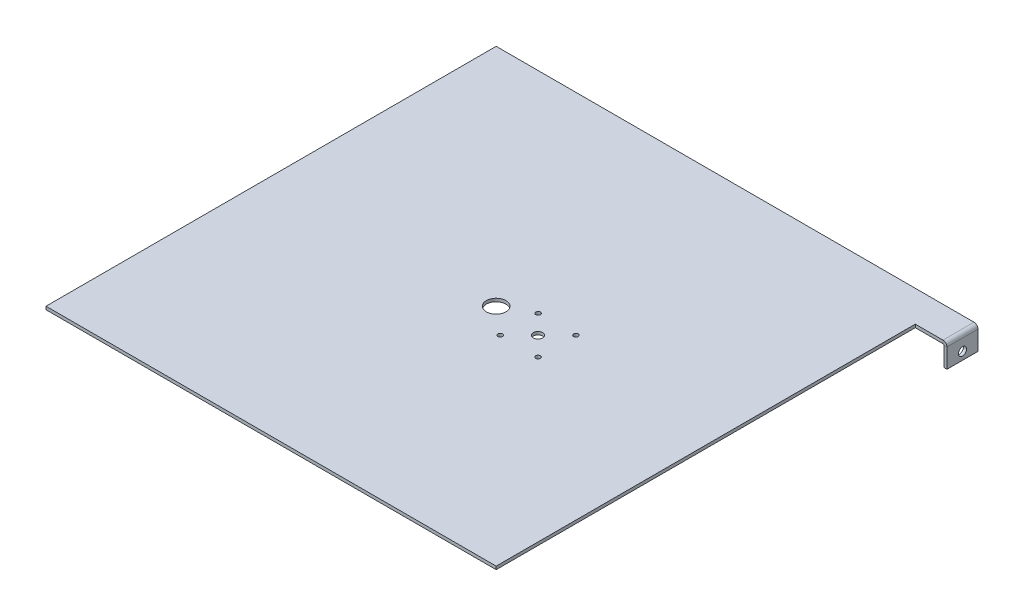
ISO-10303-21;
HEADER;
FILE_DESCRIPTION(('STEP AP214'),'2;1');
FILE_NAME('part.step','',(''),(''),'','','');
FILE_SCHEMA(('AUTOMOTIVE_DESIGN { 1 0 10303 214 1 1 1 1 }'));
ENDSEC;
DATA;
#1=APPLICATION_CONTEXT('core data for automotive mechanical design processes');
#2=APPLICATION_PROTOCOL_DEFINITION('international standard','automotive_design',2000,#1);
#3=PRODUCT_CONTEXT('',#1,'mechanical');
#4=PRODUCT('Part','Part','',(#3));
#5=PRODUCT_RELATED_PRODUCT_CATEGORY('part','',(#4));
#6=PRODUCT_DEFINITION_FORMATION('','',#4);
#7=PRODUCT_DEFINITION_CONTEXT('part definition',#1,'design');
#8=PRODUCT_DEFINITION('design','',#6,#7);
#9=PRODUCT_DEFINITION_SHAPE('','',#8);
#10=(LENGTH_UNIT() NAMED_UNIT(*) SI_UNIT(.MILLI.,.METRE.));
#11=(NAMED_UNIT(*) PLANE_ANGLE_UNIT() SI_UNIT($,.RADIAN.));
#12=(NAMED_UNIT(*) SI_UNIT($,.STERADIAN.) SOLID_ANGLE_UNIT());
#13=UNCERTAINTY_MEASURE_WITH_UNIT(LENGTH_MEASURE(1.E-05),#10,'distance_accuracy_value','');
#14=(GEOMETRIC_REPRESENTATION_CONTEXT(3) GLOBAL_UNCERTAINTY_ASSIGNED_CONTEXT((#13)) GLOBAL_UNIT_ASSIGNED_CONTEXT((#10,
#11,#12)) REPRESENTATION_CONTEXT('',''));
#15=CARTESIAN_POINT('',(0.,0.,0.));
#16=DIRECTION('',(0.,0.,1.));
#17=DIRECTION('',(1.,0.,0.));
#18=AXIS2_PLACEMENT_3D('',#15,#16,#17);
#19=CARTESIAN_POINT('',(368.3,-2.54,-342.9));
#20=DIRECTION('',(0.,0.,1.));
#21=DIRECTION('',(1.,0.,0.));
#22=AXIS2_PLACEMENT_3D('',#19,#20,#21);
#23=PLANE('',#22);
#24=DIRECTION('',(1.,0.,0.));
#25=VECTOR('',#24,1.);
#26=CARTESIAN_POINT('',(368.3,-2.54,-342.9));
#27=LINE('',#26,#25);
#28=CARTESIAN_POINT('',(368.3,-2.54,-342.9));
#29=VERTEX_POINT('',#28);
#30=CARTESIAN_POINT('',(390.9314,-2.54,-342.9));
#31=VERTEX_POINT('',#30);
#32=EDGE_CURVE('E249',#29,#31,#27,.T.);
#33=ORIENTED_EDGE('',*,*,#32,.T.);
#34=DIRECTION('',(0.,1.,0.));
#35=VECTOR('',#34,1.);
#36=CARTESIAN_POINT('',(390.9314,-2.53999999999999,-342.9));
#37=LINE('',#36,#35);
#38=CARTESIAN_POINT('',(390.9314,0.,-342.9));
#39=VERTEX_POINT('',#38);
#40=EDGE_CURVE('E194',#31,#39,#37,.T.);
#41=ORIENTED_EDGE('',*,*,#40,.T.);
#42=DIRECTION('',(1.,0.,0.));
#43=VECTOR('',#42,1.);
#44=CARTESIAN_POINT('',(368.3,0.,-342.9));
#45=LINE('',#44,#43);
#46=CARTESIAN_POINT('',(368.3,0.,-342.9));
#47=VERTEX_POINT('',#46);
#48=EDGE_CURVE('E261',#47,#39,#45,.T.);
#49=ORIENTED_EDGE('',*,*,#48,.F.);
#50=DIRECTION('',(0.,1.,0.));
#51=VECTOR('',#50,1.);
#52=CARTESIAN_POINT('',(368.3,-2.54,-342.9));
#53=LINE('',#52,#51);
#54=EDGE_CURVE('E64',#29,#47,#53,.T.);
#55=ORIENTED_EDGE('',*,*,#54,.F.);
#56=EDGE_LOOP('',(#33,#41,#49,#55));
#57=FACE_BOUND('',#56,.T.);
#58=ADVANCED_FACE('F55',(#57),#23,.T.);
#59=CARTESIAN_POINT('',(0.,-2.54,0.));
#60=DIRECTION('',(0.,-1.,0.));
#61=DIRECTION('',(0.,0.,-1.));
#62=AXIS2_PLACEMENT_3D('',#59,#60,#61);
#63=PLANE('',#62);
#64=CARTESIAN_POINT('',(184.15,-2.54,-184.15));
#65=DIRECTION('',(0.,-1.,0.));
#66=DIRECTION('',(0.,0.,-1.));
#67=AXIS2_PLACEMENT_3D('',#64,#65,#66);
#68=CIRCLE('',#67,7.99999999999999);
#69=CARTESIAN_POINT('',(184.15,-2.54,-192.15));
#70=VERTEX_POINT('',#69);
#71=EDGE_CURVE('E201',#70,#70,#68,.T.);
#72=ORIENTED_EDGE('',*,*,#71,.F.);
#73=EDGE_LOOP('',(#72));
#74=FACE_BOUND('',#73,.T.);
#75=CARTESIAN_POINT('',(206.350041512759,-2.54,-165.243580341639));
#76=DIRECTION('',(0.,-1.,0.));
#77=DIRECTION('',(0.,0.,-1.));
#78=AXIS2_PLACEMENT_3D('',#75,#76,#77);
#79=CIRCLE('',#78,1.90499999999999);
#80=CARTESIAN_POINT('',(206.350041512759,-2.54,-167.148580341639));
#81=VERTEX_POINT('',#80);
#82=EDGE_CURVE('E226',#81,#81,#79,.F.);
#83=ORIENTED_EDGE('',*,*,#82,.T.);
#84=EDGE_LOOP('',(#83));
#85=FACE_BOUND('',#84,.T.);
#86=CARTESIAN_POINT('',(206.350041512759,-2.54,-196.231580341639));
#87=DIRECTION('',(0.,-1.,0.));
#88=DIRECTION('',(0.,0.,-1.));
#89=AXIS2_PLACEMENT_3D('',#86,#87,#88);
#90=CIRCLE('',#89,1.90499999999999);
#91=CARTESIAN_POINT('',(206.350041512759,-2.54,-198.136580341639));
#92=VERTEX_POINT('',#91);
#93=EDGE_CURVE('E220',#92,#92,#90,.F.);
#94=ORIENTED_EDGE('',*,*,#93,.T.);
#95=EDGE_LOOP('',(#94));
#96=FACE_BOUND('',#95,.T.);
#97=CARTESIAN_POINT('',(237.33804151276,-2.54,-196.231580341639));
#98=DIRECTION('',(0.,-1.,0.));
#99=DIRECTION('',(0.,0.,-1.));
#100=AXIS2_PLACEMENT_3D('',#97,#98,#99);
#101=CIRCLE('',#100,1.90499999999999);
#102=CARTESIAN_POINT('',(237.33804151276,-2.54,-198.136580341639));
#103=VERTEX_POINT('',#102);
#104=EDGE_CURVE('E213',#103,#103,#101,.F.);
#105=ORIENTED_EDGE('',*,*,#104,.T.);
#106=EDGE_LOOP('',(#105));
#107=FACE_BOUND('',#106,.T.);
#108=CARTESIAN_POINT('',(237.33804151276,-2.54,-165.243580341639));
#109=DIRECTION('',(0.,-1.,0.));
#110=DIRECTION('',(0.,0.,-1.));
#111=AXIS2_PLACEMENT_3D('',#108,#109,#110);
#112=CIRCLE('',#111,1.90499999999999);
#113=CARTESIAN_POINT('',(237.33804151276,-2.54,-167.148580341639));
#114=VERTEX_POINT('',#113);
#115=EDGE_CURVE('E212',#114,#114,#112,.F.);
#116=ORIENTED_EDGE('',*,*,#115,.T.);
#117=EDGE_LOOP('',(#116));
#118=FACE_BOUND('',#117,.T.);
#119=CARTESIAN_POINT('',(221.84404151276,-2.54,-180.737580341639));
#120=DIRECTION('',(0.,-1.,0.));
#121=DIRECTION('',(0.,0.,-1.));
#122=AXIS2_PLACEMENT_3D('',#119,#120,#121);
#123=CIRCLE('',#122,3.80999999999998);
#124=CARTESIAN_POINT('',(221.84404151276,-2.54,-184.547580341639));
#125=VERTEX_POINT('',#124);
#126=EDGE_CURVE('E235',#125,#125,#123,.F.);
#127=ORIENTED_EDGE('',*,*,#126,.T.);
#128=EDGE_LOOP('',(#127));
#129=FACE_BOUND('',#128,.T.);
#130=DIRECTION('',(-1.,0.,0.));
#131=VECTOR('',#130,1.);
#132=CARTESIAN_POINT('',(368.3,-2.54,-368.3));
#133=LINE('',#132,#131);
#134=CARTESIAN_POINT('',(390.9314,-2.54,-368.3));
#135=VERTEX_POINT('',#134);
#136=CARTESIAN_POINT('',(0.,-2.54,-368.3));
#137=VERTEX_POINT('',#136);
#138=EDGE_CURVE('E251',#135,#137,#133,.T.);
#139=ORIENTED_EDGE('',*,*,#138,.F.);
#140=DIRECTION('',(0.,0.,1.));
#141=VECTOR('',#140,1.);
#142=CARTESIAN_POINT('',(390.9314,-2.53999999999999,-342.9));
#143=LINE('',#142,#141);
#144=EDGE_CURVE('E72',#31,#135,#143,.F.);
#145=ORIENTED_EDGE('',*,*,#144,.F.);
#146=ORIENTED_EDGE('',*,*,#32,.F.);
#147=DIRECTION('',(0.,0.,-1.));
#148=VECTOR('',#147,1.);
#149=CARTESIAN_POINT('',(368.3,-2.54,0.));
#150=LINE('',#149,#148);
#151=CARTESIAN_POINT('',(368.3,-2.54,0.));
#152=VERTEX_POINT('',#151);
#153=EDGE_CURVE('E246',#152,#29,#150,.T.);
#154=ORIENTED_EDGE('',*,*,#153,.F.);
#155=DIRECTION('',(1.,0.,0.));
#156=VECTOR('',#155,1.);
#157=CARTESIAN_POINT('',(0.,-2.54,0.));
#158=LINE('',#157,#156);
#159=CARTESIAN_POINT('',(0.,-2.54,0.));
#160=VERTEX_POINT('',#159);
#161=EDGE_CURVE('E242',#160,#152,#158,.T.);
#162=ORIENTED_EDGE('',*,*,#161,.F.);
#163=DIRECTION('',(0.,0.,1.));
#164=VECTOR('',#163,1.);
#165=CARTESIAN_POINT('',(0.,-2.54,0.));
#166=LINE('',#165,#164);
#167=EDGE_CURVE('E239',#137,#160,#166,.T.);
#168=ORIENTED_EDGE('',*,*,#167,.F.);
#169=EDGE_LOOP('',(#139,#145,#146,#154,#162,#168));
#170=FACE_BOUND('',#169,.T.);
#171=ADVANCED_FACE('F278',(#74,#85,#96,#107,#118,#129,#170),#63,.T.);
#172=CARTESIAN_POINT('',(0.,0.,0.));
#173=DIRECTION('',(0.,-1.,0.));
#174=DIRECTION('',(0.,0.,-1.));
#175=AXIS2_PLACEMENT_3D('',#172,#173,#174);
#176=PLANE('',#175);
#177=CARTESIAN_POINT('',(221.84404151276,0.,-180.737580341639));
#178=DIRECTION('',(0.,1.,0.));
#179=DIRECTION('',(0.,0.,1.));
#180=AXIS2_PLACEMENT_3D('',#177,#178,#179);
#181=CIRCLE('',#180,3.80999999999998);
#182=CARTESIAN_POINT('',(221.84404151276,0.,-176.927580341639));
#183=VERTEX_POINT('',#182);
#184=EDGE_CURVE('E216',#183,#183,#181,.T.);
#185=ORIENTED_EDGE('',*,*,#184,.F.);
#186=EDGE_LOOP('',(#185));
#187=FACE_BOUND('',#186,.T.);
#188=CARTESIAN_POINT('',(237.33804151276,0.,-165.243580341639));
#189=DIRECTION('',(0.,1.,0.));
#190=DIRECTION('',(0.,0.,1.));
#191=AXIS2_PLACEMENT_3D('',#188,#189,#190);
#192=CIRCLE('',#191,1.90499999999999);
#193=CARTESIAN_POINT('',(237.33804151276,0.,-163.338580341639));
#194=VERTEX_POINT('',#193);
#195=EDGE_CURVE('E209',#194,#194,#192,.T.);
#196=ORIENTED_EDGE('',*,*,#195,.F.);
#197=EDGE_LOOP('',(#196));
#198=FACE_BOUND('',#197,.T.);
#199=CARTESIAN_POINT('',(237.33804151276,0.,-196.231580341639));
#200=DIRECTION('',(0.,1.,0.));
#201=DIRECTION('',(0.,0.,1.));
#202=AXIS2_PLACEMENT_3D('',#199,#200,#201);
#203=CIRCLE('',#202,1.90499999999999);
#204=CARTESIAN_POINT('',(237.33804151276,0.,-194.326580341639));
#205=VERTEX_POINT('',#204);
#206=EDGE_CURVE('E217',#205,#205,#203,.T.);
#207=ORIENTED_EDGE('',*,*,#206,.F.);
#208=EDGE_LOOP('',(#207));
#209=FACE_BOUND('',#208,.T.);
#210=CARTESIAN_POINT('',(206.350041512759,0.,-196.231580341639));
#211=DIRECTION('',(0.,1.,0.));
#212=DIRECTION('',(0.,0.,1.));
#213=AXIS2_PLACEMENT_3D('',#210,#211,#212);
#214=CIRCLE('',#213,1.90499999999999);
#215=CARTESIAN_POINT('',(206.350041512759,0.,-194.326580341639));
#216=VERTEX_POINT('',#215);
#217=EDGE_CURVE('E223',#216,#216,#214,.T.);
#218=ORIENTED_EDGE('',*,*,#217,.F.);
#219=EDGE_LOOP('',(#218));
#220=FACE_BOUND('',#219,.T.);
#221=CARTESIAN_POINT('',(206.350041512759,0.,-165.243580341639));
#222=DIRECTION('',(0.,1.,0.));
#223=DIRECTION('',(0.,0.,1.));
#224=AXIS2_PLACEMENT_3D('',#221,#222,#223);
#225=CIRCLE('',#224,1.90499999999999);
#226=CARTESIAN_POINT('',(206.350041512759,0.,-163.338580341639));
#227=VERTEX_POINT('',#226);
#228=EDGE_CURVE('E206',#227,#227,#225,.T.);
#229=ORIENTED_EDGE('',*,*,#228,.F.);
#230=EDGE_LOOP('',(#229));
#231=FACE_BOUND('',#230,.T.);
#232=CARTESIAN_POINT('',(184.15,0.,-184.15));
#233=DIRECTION('',(0.,-1.,0.));
#234=DIRECTION('',(0.,0.,-1.));
#235=AXIS2_PLACEMENT_3D('',#232,#233,#234);
#236=CIRCLE('',#235,7.99999999999999);
#237=CARTESIAN_POINT('',(184.15,0.,-192.15));
#238=VERTEX_POINT('',#237);
#239=EDGE_CURVE('E203',#238,#238,#236,.T.);
#240=ORIENTED_EDGE('',*,*,#239,.T.);
#241=EDGE_LOOP('',(#240));
#242=FACE_BOUND('',#241,.T.);
#243=DIRECTION('',(0.,0.,1.));
#244=VECTOR('',#243,1.);
#245=CARTESIAN_POINT('',(390.9314,0.,-342.9));
#246=LINE('',#245,#244);
#247=CARTESIAN_POINT('',(390.9314,0.,-368.3));
#248=VERTEX_POINT('',#247);
#249=EDGE_CURVE('E143',#39,#248,#246,.F.);
#250=ORIENTED_EDGE('',*,*,#249,.T.);
#251=DIRECTION('',(-1.,0.,0.));
#252=VECTOR('',#251,1.);
#253=CARTESIAN_POINT('',(0.,0.,-368.3));
#254=LINE('',#253,#252);
#255=CARTESIAN_POINT('',(0.,0.,-368.3));
#256=VERTEX_POINT('',#255);
#257=EDGE_CURVE('E243',#248,#256,#254,.T.);
#258=ORIENTED_EDGE('',*,*,#257,.T.);
#259=DIRECTION('',(0.,0.,1.));
#260=VECTOR('',#259,1.);
#261=CARTESIAN_POINT('',(0.,0.,0.));
#262=LINE('',#261,#260);
#263=CARTESIAN_POINT('',(0.,0.,0.));
#264=VERTEX_POINT('',#263);
#265=EDGE_CURVE('E238',#256,#264,#262,.T.);
#266=ORIENTED_EDGE('',*,*,#265,.T.);
#267=DIRECTION('',(1.,0.,0.));
#268=VECTOR('',#267,1.);
#269=CARTESIAN_POINT('',(0.,0.,0.));
#270=LINE('',#269,#268);
#271=CARTESIAN_POINT('',(368.3,0.,0.));
#272=VERTEX_POINT('',#271);
#273=EDGE_CURVE('E255',#264,#272,#270,.T.);
#274=ORIENTED_EDGE('',*,*,#273,.T.);
#275=DIRECTION('',(0.,0.,-1.));
#276=VECTOR('',#275,1.);
#277=CARTESIAN_POINT('',(368.3,0.,0.));
#278=LINE('',#277,#276);
#279=EDGE_CURVE('E258',#272,#47,#278,.T.);
#280=ORIENTED_EDGE('',*,*,#279,.T.);
#281=ORIENTED_EDGE('',*,*,#48,.T.);
#282=EDGE_LOOP('',(#250,#258,#266,#274,#280,#281));
#283=FACE_BOUND('',#282,.T.);
#284=ADVANCED_FACE('F276',(#187,#198,#209,#220,#231,#242,#283),#176,.F.);
#285=CARTESIAN_POINT('',(0.,-2.54,0.));
#286=DIRECTION('',(-1.,0.,0.));
#287=DIRECTION('',(0.,0.,1.));
#288=AXIS2_PLACEMENT_3D('',#285,#286,#287);
#289=PLANE('',#288);
#290=ORIENTED_EDGE('',*,*,#265,.F.);
#291=DIRECTION('',(0.,1.,0.));
#292=VECTOR('',#291,1.);
#293=CARTESIAN_POINT('',(0.,-2.54,-368.3));
#294=LINE('',#293,#292);
#295=EDGE_CURVE('E13',#137,#256,#294,.T.);
#296=ORIENTED_EDGE('',*,*,#295,.F.);
#297=ORIENTED_EDGE('',*,*,#167,.T.);
#298=DIRECTION('',(0.,1.,0.));
#299=VECTOR('',#298,1.);
#300=CARTESIAN_POINT('',(0.,-2.54,0.));
#301=LINE('',#300,#299);
#302=EDGE_CURVE('E59',#160,#264,#301,.T.);
#303=ORIENTED_EDGE('',*,*,#302,.T.);
#304=EDGE_LOOP('',(#290,#296,#297,#303));
#305=FACE_BOUND('',#304,.T.);
#306=ADVANCED_FACE('F57',(#305),#289,.T.);
#307=CARTESIAN_POINT('',(0.,-2.54,-368.3));
#308=DIRECTION('',(0.,0.,-1.));
#309=DIRECTION('',(-1.,0.,0.));
#310=AXIS2_PLACEMENT_3D('',#307,#308,#309);
#311=PLANE('',#310);
#312=DIRECTION('',(0.,1.,0.));
#313=VECTOR('',#312,1.);
#314=CARTESIAN_POINT('',(390.9314,-2.53999999999999,-368.3));
#315=LINE('',#314,#313);
#316=EDGE_CURVE('E80',#135,#248,#315,.T.);
#317=ORIENTED_EDGE('',*,*,#316,.F.);
#318=ORIENTED_EDGE('',*,*,#138,.T.);
#319=ORIENTED_EDGE('',*,*,#295,.T.);
#320=ORIENTED_EDGE('',*,*,#257,.F.);
#321=EDGE_LOOP('',(#317,#318,#319,#320));
#322=FACE_BOUND('',#321,.T.);
#323=ADVANCED_FACE('F277',(#322),#311,.T.);
#324=CARTESIAN_POINT('',(368.3,-2.54,0.));
#325=DIRECTION('',(1.,0.,0.));
#326=DIRECTION('',(0.,0.,-1.));
#327=AXIS2_PLACEMENT_3D('',#324,#325,#326);
#328=PLANE('',#327);
#329=ORIENTED_EDGE('',*,*,#279,.F.);
#330=DIRECTION('',(0.,1.,0.));
#331=VECTOR('',#330,1.);
#332=CARTESIAN_POINT('',(368.3,-2.54,0.));
#333=LINE('',#332,#331);
#334=EDGE_CURVE('E265',#152,#272,#333,.T.);
#335=ORIENTED_EDGE('',*,*,#334,.F.);
#336=ORIENTED_EDGE('',*,*,#153,.T.);
#337=ORIENTED_EDGE('',*,*,#54,.T.);
#338=EDGE_LOOP('',(#329,#335,#336,#337));
#339=FACE_BOUND('',#338,.T.);
#340=ADVANCED_FACE('F281',(#339),#328,.T.);
#341=CARTESIAN_POINT('',(0.,-2.54,0.));
#342=DIRECTION('',(0.,0.,1.));
#343=DIRECTION('',(1.,0.,0.));
#344=AXIS2_PLACEMENT_3D('',#341,#342,#343);
#345=PLANE('',#344);
#346=ORIENTED_EDGE('',*,*,#273,.F.);
#347=ORIENTED_EDGE('',*,*,#302,.F.);
#348=ORIENTED_EDGE('',*,*,#161,.T.);
#349=ORIENTED_EDGE('',*,*,#334,.T.);
#350=EDGE_LOOP('',(#346,#347,#348,#349));
#351=FACE_BOUND('',#350,.T.);
#352=ADVANCED_FACE('F274',(#351),#345,.T.);
#353=CARTESIAN_POINT('',(221.84404151276,-13.3163073452829,-180.737580341639));
#354=DIRECTION('',(0.,1.,0.));
#355=DIRECTION('',(0.,0.,1.));
#356=AXIS2_PLACEMENT_3D('',#353,#354,#355);
#357=CYLINDRICAL_SURFACE('',#356,3.80999999999998);
#358=ORIENTED_EDGE('',*,*,#184,.T.);
#359=EDGE_LOOP('',(#358));
#360=FACE_BOUND('',#359,.T.);
#361=ORIENTED_EDGE('',*,*,#126,.F.);
#362=EDGE_LOOP('',(#361));
#363=FACE_BOUND('',#362,.T.);
#364=ADVANCED_FACE('F331',(#360,#363),#357,.F.);
#365=CARTESIAN_POINT('',(237.33804151276,-13.3163073452829,-165.243580341639));
#366=DIRECTION('',(0.,1.,0.));
#367=DIRECTION('',(0.,0.,1.));
#368=AXIS2_PLACEMENT_3D('',#365,#366,#367);
#369=CYLINDRICAL_SURFACE('',#368,1.90499999999999);
#370=ORIENTED_EDGE('',*,*,#195,.T.);
#371=EDGE_LOOP('',(#370));
#372=FACE_BOUND('',#371,.T.);
#373=ORIENTED_EDGE('',*,*,#115,.F.);
#374=EDGE_LOOP('',(#373));
#375=FACE_BOUND('',#374,.T.);
#376=ADVANCED_FACE('F335',(#372,#375),#369,.F.);
#377=CARTESIAN_POINT('',(237.33804151276,-13.3163073452829,-196.231580341639));
#378=DIRECTION('',(0.,1.,0.));
#379=DIRECTION('',(0.,0.,1.));
#380=AXIS2_PLACEMENT_3D('',#377,#378,#379);
#381=CYLINDRICAL_SURFACE('',#380,1.90499999999999);
#382=ORIENTED_EDGE('',*,*,#206,.T.);
#383=EDGE_LOOP('',(#382));
#384=FACE_BOUND('',#383,.T.);
#385=ORIENTED_EDGE('',*,*,#104,.F.);
#386=EDGE_LOOP('',(#385));
#387=FACE_BOUND('',#386,.T.);
#388=ADVANCED_FACE('F341',(#384,#387),#381,.F.);
#389=CARTESIAN_POINT('',(206.350041512759,-13.3163073452829,-196.231580341639));
#390=DIRECTION('',(0.,1.,0.));
#391=DIRECTION('',(0.,0.,1.));
#392=AXIS2_PLACEMENT_3D('',#389,#390,#391);
#393=CYLINDRICAL_SURFACE('',#392,1.90499999999999);
#394=ORIENTED_EDGE('',*,*,#217,.T.);
#395=EDGE_LOOP('',(#394));
#396=FACE_BOUND('',#395,.T.);
#397=ORIENTED_EDGE('',*,*,#93,.F.);
#398=EDGE_LOOP('',(#397));
#399=FACE_BOUND('',#398,.T.);
#400=ADVANCED_FACE('F384',(#396,#399),#393,.F.);
#401=CARTESIAN_POINT('',(206.350041512759,-13.3163073452829,-165.243580341639));
#402=DIRECTION('',(0.,1.,0.));
#403=DIRECTION('',(0.,0.,1.));
#404=AXIS2_PLACEMENT_3D('',#401,#402,#403);
#405=CYLINDRICAL_SURFACE('',#404,1.90499999999999);
#406=ORIENTED_EDGE('',*,*,#228,.T.);
#407=EDGE_LOOP('',(#406));
#408=FACE_BOUND('',#407,.T.);
#409=ORIENTED_EDGE('',*,*,#82,.F.);
#410=EDGE_LOOP('',(#409));
#411=FACE_BOUND('',#410,.T.);
#412=ADVANCED_FACE('F346',(#408,#411),#405,.F.);
#413=CARTESIAN_POINT('',(184.15,0.,-184.15));
#414=DIRECTION('',(0.,-1.,0.));
#415=DIRECTION('',(0.,0.,-1.));
#416=AXIS2_PLACEMENT_3D('',#413,#414,#415);
#417=CYLINDRICAL_SURFACE('',#416,7.99999999999999);
#418=ORIENTED_EDGE('',*,*,#239,.F.);
#419=EDGE_LOOP('',(#418));
#420=FACE_BOUND('',#419,.T.);
#421=ORIENTED_EDGE('',*,*,#71,.T.);
#422=EDGE_LOOP('',(#421));
#423=FACE_BOUND('',#422,.T.);
#424=ADVANCED_FACE('F365',(#420,#423),#417,.F.);
#425=CARTESIAN_POINT('',(390.9314,-3.27659999999997,-368.3));
#426=DIRECTION('',(0.,0.,-1.));
#427=DIRECTION('',(-1.,0.,0.));
#428=AXIS2_PLACEMENT_3D('',#425,#426,#427);
#429=PLANE('',#428);
#430=DIRECTION('',(1.,0.,0.));
#431=VECTOR('',#430,1.);
#432=CARTESIAN_POINT('',(394.208,-3.27659999999996,-368.3));
#433=LINE('',#432,#431);
#434=CARTESIAN_POINT('',(391.668,-3.27659999999996,-368.3));
#435=VERTEX_POINT('',#434);
#436=CARTESIAN_POINT('',(394.208,-3.27659999999995,-368.3));
#437=VERTEX_POINT('',#436);
#438=EDGE_CURVE('E188',#435,#437,#433,.T.);
#439=ORIENTED_EDGE('',*,*,#438,.F.);
#440=CARTESIAN_POINT('',(390.9314,-3.27659999999997,-368.3));
#441=DIRECTION('',(0.,0.,1.));
#442=DIRECTION('',(1.,0.,0.));
#443=AXIS2_PLACEMENT_3D('',#440,#441,#442);
#444=CIRCLE('',#443,0.736599999999976);
#445=EDGE_CURVE('E146',#135,#435,#444,.F.);
#446=ORIENTED_EDGE('',*,*,#445,.F.);
#447=ORIENTED_EDGE('',*,*,#316,.T.);
#448=CARTESIAN_POINT('',(390.9314,-3.27659999999997,-368.3));
#449=DIRECTION('',(0.,0.,1.));
#450=DIRECTION('',(1.,0.,0.));
#451=AXIS2_PLACEMENT_3D('',#448,#449,#450);
#452=CIRCLE('',#451,3.27659999999998);
#453=EDGE_CURVE('E193',#248,#437,#452,.F.);
#454=ORIENTED_EDGE('',*,*,#453,.T.);
#455=EDGE_LOOP('',(#439,#446,#447,#454));
#456=FACE_BOUND('',#455,.T.);
#457=ADVANCED_FACE('F368',(#456),#429,.T.);
#458=CARTESIAN_POINT('',(390.9314,-3.27659999999997,-342.9));
#459=DIRECTION('',(0.,0.,-1.));
#460=DIRECTION('',(-1.,0.,0.));
#461=AXIS2_PLACEMENT_3D('',#458,#459,#460);
#462=PLANE('',#461);
#463=CARTESIAN_POINT('',(390.9314,-3.27659999999997,-342.9));
#464=DIRECTION('',(0.,0.,1.));
#465=DIRECTION('',(1.,0.,0.));
#466=AXIS2_PLACEMENT_3D('',#463,#464,#465);
#467=CIRCLE('',#466,0.736599999999976);
#468=CARTESIAN_POINT('',(391.668,-3.27659999999996,-342.9));
#469=VERTEX_POINT('',#468);
#470=EDGE_CURVE('E153',#469,#31,#467,.T.);
#471=ORIENTED_EDGE('',*,*,#470,.F.);
#472=DIRECTION('',(1.,0.,0.));
#473=VECTOR('',#472,1.);
#474=CARTESIAN_POINT('',(391.668,-3.27659999999996,-342.9));
#475=LINE('',#474,#473);
#476=CARTESIAN_POINT('',(394.208,-3.27659999999995,-342.9));
#477=VERTEX_POINT('',#476);
#478=EDGE_CURVE('E150',#469,#477,#475,.T.);
#479=ORIENTED_EDGE('',*,*,#478,.T.);
#480=CARTESIAN_POINT('',(390.9314,-3.27659999999997,-342.9));
#481=DIRECTION('',(0.,0.,1.));
#482=DIRECTION('',(1.,0.,0.));
#483=AXIS2_PLACEMENT_3D('',#480,#481,#482);
#484=CIRCLE('',#483,3.27659999999998);
#485=EDGE_CURVE('E136',#477,#39,#484,.T.);
#486=ORIENTED_EDGE('',*,*,#485,.T.);
#487=ORIENTED_EDGE('',*,*,#40,.F.);
#488=EDGE_LOOP('',(#471,#479,#486,#487));
#489=FACE_BOUND('',#488,.T.);
#490=ADVANCED_FACE('F151',(#489),#462,.F.);
#491=CARTESIAN_POINT('',(390.9314,-3.27659999999997,-342.9));
#492=DIRECTION('',(0.,0.,1.));
#493=DIRECTION('',(1.,0.,0.));
#494=AXIS2_PLACEMENT_3D('',#491,#492,#493);
#495=CYLINDRICAL_SURFACE('',#494,3.27659999999998);
#496=ORIENTED_EDGE('',*,*,#249,.F.);
#497=ORIENTED_EDGE('',*,*,#485,.F.);
#498=DIRECTION('',(0.,0.,1.));
#499=VECTOR('',#498,1.);
#500=CARTESIAN_POINT('',(394.208,-3.27659999999995,0.));
#501=LINE('',#500,#499);
#502=EDGE_CURVE('E141',#437,#477,#501,.T.);
#503=ORIENTED_EDGE('',*,*,#502,.F.);
#504=ORIENTED_EDGE('',*,*,#453,.F.);
#505=EDGE_LOOP('',(#496,#497,#503,#504));
#506=FACE_BOUND('',#505,.T.);
#507=ADVANCED_FACE('F138',(#506),#495,.T.);
#508=CARTESIAN_POINT('',(390.9314,-3.27659999999997,-342.9));
#509=DIRECTION('',(0.,0.,1.));
#510=DIRECTION('',(1.,0.,0.));
#511=AXIS2_PLACEMENT_3D('',#508,#509,#510);
#512=CYLINDRICAL_SURFACE('',#511,0.736599999999976);
#513=ORIENTED_EDGE('',*,*,#144,.T.);
#514=ORIENTED_EDGE('',*,*,#445,.T.);
#515=DIRECTION('',(0.,0.,-1.));
#516=VECTOR('',#515,1.);
#517=CARTESIAN_POINT('',(391.668,-3.27659999999996,-368.3));
#518=LINE('',#517,#516);
#519=EDGE_CURVE('E158',#435,#469,#518,.F.);
#520=ORIENTED_EDGE('',*,*,#519,.T.);
#521=ORIENTED_EDGE('',*,*,#470,.T.);
#522=EDGE_LOOP('',(#513,#514,#520,#521));
#523=FACE_BOUND('',#522,.T.);
#524=ADVANCED_FACE('F285',(#523),#512,.F.);
#525=CARTESIAN_POINT('',(394.208,-2.53999999999999,-342.9));
#526=DIRECTION('',(0.,0.,1.));
#527=DIRECTION('',(1.,0.,0.));
#528=AXIS2_PLACEMENT_3D('',#525,#526,#527);
#529=PLANE('',#528);
#530=DIRECTION('',(0.,1.,0.));
#531=VECTOR('',#530,1.);
#532=CARTESIAN_POINT('',(394.208,-2.53999999999999,-342.9));
#533=LINE('',#532,#531);
#534=CARTESIAN_POINT('',(394.208,-19.05,-342.9));
#535=VERTEX_POINT('',#534);
#536=EDGE_CURVE('E165',#535,#477,#533,.T.);
#537=ORIENTED_EDGE('',*,*,#536,.T.);
#538=ORIENTED_EDGE('',*,*,#478,.F.);
#539=DIRECTION('',(0.,-1.,0.));
#540=VECTOR('',#539,1.);
#541=CARTESIAN_POINT('',(391.668,1.32543548786019E-12,-342.9));
#542=LINE('',#541,#540);
#543=CARTESIAN_POINT('',(391.668,-19.05,-342.9));
#544=VERTEX_POINT('',#543);
#545=EDGE_CURVE('E181',#544,#469,#542,.F.);
#546=ORIENTED_EDGE('',*,*,#545,.F.);
#547=DIRECTION('',(-1.,0.,0.));
#548=VECTOR('',#547,1.);
#549=CARTESIAN_POINT('',(394.208,-19.05,-342.9));
#550=LINE('',#549,#548);
#551=EDGE_CURVE('E170',#535,#544,#550,.T.);
#552=ORIENTED_EDGE('',*,*,#551,.F.);
#553=EDGE_LOOP('',(#537,#538,#546,#552));
#554=FACE_BOUND('',#553,.T.);
#555=ADVANCED_FACE('F169',(#554),#529,.T.);
#556=CARTESIAN_POINT('',(394.208,-19.05,-368.3));
#557=DIRECTION('',(0.,0.,-1.));
#558=DIRECTION('',(-1.,0.,0.));
#559=AXIS2_PLACEMENT_3D('',#556,#557,#558);
#560=PLANE('',#559);
#561=DIRECTION('',(0.,1.,0.));
#562=VECTOR('',#561,1.);
#563=CARTESIAN_POINT('',(391.668,1.32543548786019E-12,-368.3));
#564=LINE('',#563,#562);
#565=CARTESIAN_POINT('',(391.668,-19.05,-368.3));
#566=VERTEX_POINT('',#565);
#567=EDGE_CURVE('E167',#435,#566,#564,.F.);
#568=ORIENTED_EDGE('',*,*,#567,.F.);
#569=ORIENTED_EDGE('',*,*,#438,.T.);
#570=DIRECTION('',(0.,-1.,0.));
#571=VECTOR('',#570,1.);
#572=CARTESIAN_POINT('',(394.208,-19.05,-368.3));
#573=LINE('',#572,#571);
#574=CARTESIAN_POINT('',(394.208,-19.05,-368.3));
#575=VERTEX_POINT('',#574);
#576=EDGE_CURVE('E166',#437,#575,#573,.T.);
#577=ORIENTED_EDGE('',*,*,#576,.T.);
#578=DIRECTION('',(-1.,0.,0.));
#579=VECTOR('',#578,1.);
#580=CARTESIAN_POINT('',(394.208,-19.05,-368.3));
#581=LINE('',#580,#579);
#582=EDGE_CURVE('E172',#575,#566,#581,.T.);
#583=ORIENTED_EDGE('',*,*,#582,.T.);
#584=EDGE_LOOP('',(#568,#569,#577,#583));
#585=FACE_BOUND('',#584,.T.);
#586=ADVANCED_FACE('F292',(#585),#560,.T.);
#587=CARTESIAN_POINT('',(394.208,1.33430385046085E-12,0.));
#588=DIRECTION('',(1.,0.,0.));
#589=DIRECTION('',(0.,1.,0.));
#590=AXIS2_PLACEMENT_3D('',#587,#588,#589);
#591=PLANE('',#590);
#592=CARTESIAN_POINT('',(394.208,-12.7,-355.6));
#593=DIRECTION('',(1.,0.,0.));
#594=DIRECTION('',(0.,1.,0.));
#595=AXIS2_PLACEMENT_3D('',#592,#593,#594);
#596=CIRCLE('',#595,3.30200000000004);
#597=CARTESIAN_POINT('',(394.208,-9.39799999999991,-355.6));
#598=VERTEX_POINT('',#597);
#599=EDGE_CURVE('E298',#598,#598,#596,.T.);
#600=ORIENTED_EDGE('',*,*,#599,.F.);
#601=EDGE_LOOP('',(#600));
#602=FACE_BOUND('',#601,.T.);
#603=ORIENTED_EDGE('',*,*,#576,.F.);
#604=ORIENTED_EDGE('',*,*,#502,.T.);
#605=ORIENTED_EDGE('',*,*,#536,.F.);
#606=DIRECTION('',(0.,0.,1.));
#607=VECTOR('',#606,1.);
#608=CARTESIAN_POINT('',(394.208,-19.05,-342.9));
#609=LINE('',#608,#607);
#610=EDGE_CURVE('E173',#575,#535,#609,.T.);
#611=ORIENTED_EDGE('',*,*,#610,.F.);
#612=EDGE_LOOP('',(#603,#604,#605,#611));
#613=FACE_BOUND('',#612,.T.);
#614=ADVANCED_FACE('F163',(#602,#613),#591,.T.);
#615=CARTESIAN_POINT('',(391.668,1.32543548786019E-12,0.));
#616=DIRECTION('',(1.,0.,0.));
#617=DIRECTION('',(0.,1.,0.));
#618=AXIS2_PLACEMENT_3D('',#615,#616,#617);
#619=PLANE('',#618);
#620=CARTESIAN_POINT('',(391.668,-12.7,-355.6));
#621=DIRECTION('',(1.,0.,0.));
#622=DIRECTION('',(0.,1.,0.));
#623=AXIS2_PLACEMENT_3D('',#620,#621,#622);
#624=CIRCLE('',#623,3.30200000000004);
#625=CARTESIAN_POINT('',(391.668,-9.39799999999992,-355.6));
#626=VERTEX_POINT('',#625);
#627=EDGE_CURVE('E191',#626,#626,#624,.T.);
#628=ORIENTED_EDGE('',*,*,#627,.T.);
#629=EDGE_LOOP('',(#628));
#630=FACE_BOUND('',#629,.T.);
#631=ORIENTED_EDGE('',*,*,#519,.F.);
#632=ORIENTED_EDGE('',*,*,#567,.T.);
#633=DIRECTION('',(0.,0.,-1.));
#634=VECTOR('',#633,1.);
#635=CARTESIAN_POINT('',(391.668,-19.05,0.));
#636=LINE('',#635,#634);
#637=EDGE_CURVE('E183',#566,#544,#636,.F.);
#638=ORIENTED_EDGE('',*,*,#637,.T.);
#639=ORIENTED_EDGE('',*,*,#545,.T.);
#640=EDGE_LOOP('',(#631,#632,#638,#639));
#641=FACE_BOUND('',#640,.T.);
#642=ADVANCED_FACE('F290',(#630,#641),#619,.F.);
#643=CARTESIAN_POINT('',(394.208,-19.05,-342.9));
#644=DIRECTION('',(0.,-1.,0.));
#645=DIRECTION('',(1.,0.,0.));
#646=AXIS2_PLACEMENT_3D('',#643,#644,#645);
#647=PLANE('',#646);
#648=ORIENTED_EDGE('',*,*,#637,.F.);
#649=ORIENTED_EDGE('',*,*,#582,.F.);
#650=ORIENTED_EDGE('',*,*,#610,.T.);
#651=ORIENTED_EDGE('',*,*,#551,.T.);
#652=EDGE_LOOP('',(#648,#649,#650,#651));
#653=FACE_BOUND('',#652,.T.);
#654=ADVANCED_FACE('F296',(#653),#647,.T.);
#655=CARTESIAN_POINT('',(391.668,-12.7,-355.6));
#656=DIRECTION('',(1.,0.,0.));
#657=DIRECTION('',(0.,1.,0.));
#658=AXIS2_PLACEMENT_3D('',#655,#656,#657);
#659=CYLINDRICAL_SURFACE('',#658,3.30200000000004);
#660=ORIENTED_EDGE('',*,*,#627,.F.);
#661=EDGE_LOOP('',(#660));
#662=FACE_BOUND('',#661,.T.);
#663=ORIENTED_EDGE('',*,*,#599,.T.);
#664=EDGE_LOOP('',(#663));
#665=FACE_BOUND('',#664,.T.);
#666=ADVANCED_FACE('F305',(#662,#665),#659,.F.);
#667=CLOSED_SHELL('',(#58,#171,#284,#306,#323,#340,#352,#364,#376,#388,#400,#412,#424,#457,#490,
#507,#524,#555,#586,#614,#642,#654,#666));
#668=MANIFOLD_SOLID_BREP('B2',#667);
#669=ADVANCED_BREP_SHAPE_REPRESENTATION('',(#18,#668),#14);
#670=SHAPE_DEFINITION_REPRESENTATION(#9,#669);
ENDSEC;
END-ISO-10303-21;
